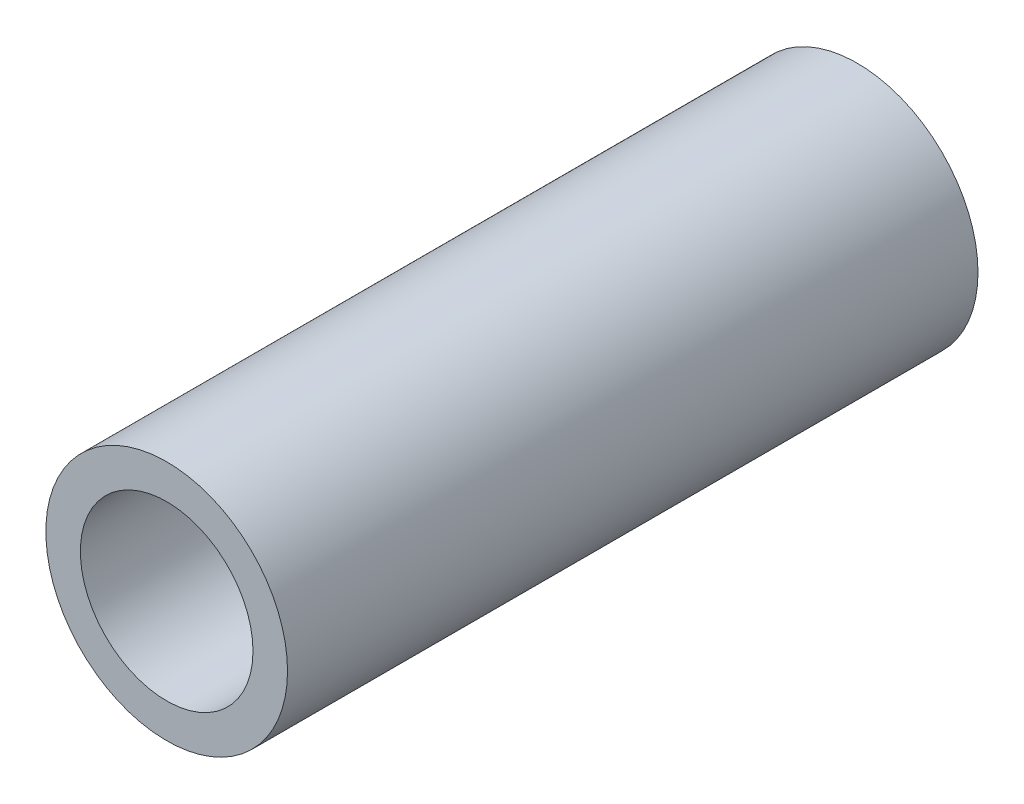
ISO-10303-21;
HEADER;
FILE_DESCRIPTION(('STEP AP214'),'2;1');
FILE_NAME('part.step','',(''),(''),'','','');
FILE_SCHEMA(('AUTOMOTIVE_DESIGN { 1 0 10303 214 1 1 1 1 }'));
ENDSEC;
DATA;
#1=APPLICATION_CONTEXT('core data for automotive mechanical design processes');
#2=APPLICATION_PROTOCOL_DEFINITION('international standard','automotive_design',2000,#1);
#3=PRODUCT_CONTEXT('',#1,'mechanical');
#4=PRODUCT('Part','Part','',(#3));
#5=PRODUCT_RELATED_PRODUCT_CATEGORY('part','',(#4));
#6=PRODUCT_DEFINITION_FORMATION('','',#4);
#7=PRODUCT_DEFINITION_CONTEXT('part definition',#1,'design');
#8=PRODUCT_DEFINITION('design','',#6,#7);
#9=PRODUCT_DEFINITION_SHAPE('','',#8);
#10=(LENGTH_UNIT() NAMED_UNIT(*) SI_UNIT(.MILLI.,.METRE.));
#11=(NAMED_UNIT(*) PLANE_ANGLE_UNIT() SI_UNIT($,.RADIAN.));
#12=(NAMED_UNIT(*) SI_UNIT($,.STERADIAN.) SOLID_ANGLE_UNIT());
#13=UNCERTAINTY_MEASURE_WITH_UNIT(LENGTH_MEASURE(1.E-05),#10,'distance_accuracy_value','');
#14=(GEOMETRIC_REPRESENTATION_CONTEXT(3) GLOBAL_UNCERTAINTY_ASSIGNED_CONTEXT((#13)) GLOBAL_UNIT_ASSIGNED_CONTEXT((#10,
#11,#12)) REPRESENTATION_CONTEXT('',''));
#15=CARTESIAN_POINT('',(0.,0.,0.));
#16=DIRECTION('',(0.,0.,1.));
#17=DIRECTION('',(1.,0.,0.));
#18=AXIS2_PLACEMENT_3D('',#15,#16,#17);
#19=CARTESIAN_POINT('',(0.,0.,10.));
#20=DIRECTION('',(0.,0.,1.));
#21=DIRECTION('',(1.,0.,0.));
#22=AXIS2_PLACEMENT_3D('',#19,#20,#21);
#23=PLANE('',#22);
#24=CARTESIAN_POINT('',(0.,0.,10.));
#25=DIRECTION('',(0.,0.,1.));
#26=DIRECTION('',(1.,0.,0.));
#27=AXIS2_PLACEMENT_3D('',#24,#25,#26);
#28=CIRCLE('',#27,3.5);
#29=CARTESIAN_POINT('',(3.5,0.,10.));
#30=VERTEX_POINT('',#29);
#31=EDGE_CURVE('E10',#30,#30,#28,.T.);
#32=ORIENTED_EDGE('',*,*,#31,.T.);
#33=EDGE_LOOP('',(#32));
#34=FACE_BOUND('',#33,.T.);
#35=CARTESIAN_POINT('',(0.,0.,10.));
#36=DIRECTION('',(0.,0.,1.));
#37=DIRECTION('',(1.,0.,0.));
#38=AXIS2_PLACEMENT_3D('',#35,#36,#37);
#39=CIRCLE('',#38,2.5);
#40=CARTESIAN_POINT('',(2.5,0.,10.));
#41=VERTEX_POINT('',#40);
#42=EDGE_CURVE('E46',#41,#41,#39,.T.);
#43=ORIENTED_EDGE('',*,*,#42,.F.);
#44=EDGE_LOOP('',(#43));
#45=FACE_BOUND('',#44,.T.);
#46=ADVANCED_FACE('F35',(#34,#45),#23,.T.);
#47=CARTESIAN_POINT('',(0.,0.,-10.));
#48=DIRECTION('',(0.,0.,1.));
#49=DIRECTION('',(1.,0.,0.));
#50=AXIS2_PLACEMENT_3D('',#47,#48,#49);
#51=PLANE('',#50);
#52=CARTESIAN_POINT('',(0.,0.,-10.));
#53=DIRECTION('',(0.,0.,1.));
#54=DIRECTION('',(1.,0.,0.));
#55=AXIS2_PLACEMENT_3D('',#52,#53,#54);
#56=CIRCLE('',#55,3.5);
#57=CARTESIAN_POINT('',(3.5,0.,-10.));
#58=VERTEX_POINT('',#57);
#59=EDGE_CURVE('E39',#58,#58,#56,.T.);
#60=ORIENTED_EDGE('',*,*,#59,.F.);
#61=EDGE_LOOP('',(#60));
#62=FACE_BOUND('',#61,.T.);
#63=CARTESIAN_POINT('',(0.,0.,-10.));
#64=DIRECTION('',(0.,0.,1.));
#65=DIRECTION('',(1.,0.,0.));
#66=AXIS2_PLACEMENT_3D('',#63,#64,#65);
#67=CIRCLE('',#66,2.5);
#68=CARTESIAN_POINT('',(2.5,0.,-10.));
#69=VERTEX_POINT('',#68);
#70=EDGE_CURVE('E48',#69,#69,#67,.T.);
#71=ORIENTED_EDGE('',*,*,#70,.T.);
#72=EDGE_LOOP('',(#71));
#73=FACE_BOUND('',#72,.T.);
#74=ADVANCED_FACE('F58',(#62,#73),#51,.F.);
#75=CARTESIAN_POINT('',(0.,0.,10.));
#76=DIRECTION('',(0.,0.,-1.));
#77=DIRECTION('',(-1.,0.,0.));
#78=AXIS2_PLACEMENT_3D('',#75,#76,#77);
#79=CYLINDRICAL_SURFACE('',#78,3.5);
#80=ORIENTED_EDGE('',*,*,#31,.F.);
#81=EDGE_LOOP('',(#80));
#82=FACE_BOUND('',#81,.T.);
#83=ORIENTED_EDGE('',*,*,#59,.T.);
#84=EDGE_LOOP('',(#83));
#85=FACE_BOUND('',#84,.T.);
#86=ADVANCED_FACE('F37',(#82,#85),#79,.T.);
#87=CARTESIAN_POINT('',(0.,0.,10.));
#88=DIRECTION('',(0.,0.,-1.));
#89=DIRECTION('',(-1.,0.,0.));
#90=AXIS2_PLACEMENT_3D('',#87,#88,#89);
#91=CYLINDRICAL_SURFACE('',#90,2.5);
#92=ORIENTED_EDGE('',*,*,#42,.T.);
#93=EDGE_LOOP('',(#92));
#94=FACE_BOUND('',#93,.T.);
#95=ORIENTED_EDGE('',*,*,#70,.F.);
#96=EDGE_LOOP('',(#95));
#97=FACE_BOUND('',#96,.T.);
#98=ADVANCED_FACE('F54',(#94,#97),#91,.F.);
#99=CLOSED_SHELL('',(#46,#74,#86,#98));
#100=MANIFOLD_SOLID_BREP('B2',#99);
#101=ADVANCED_BREP_SHAPE_REPRESENTATION('',(#18,#100),#14);
#102=SHAPE_DEFINITION_REPRESENTATION(#9,#101);
ENDSEC;
END-ISO-10303-21;
